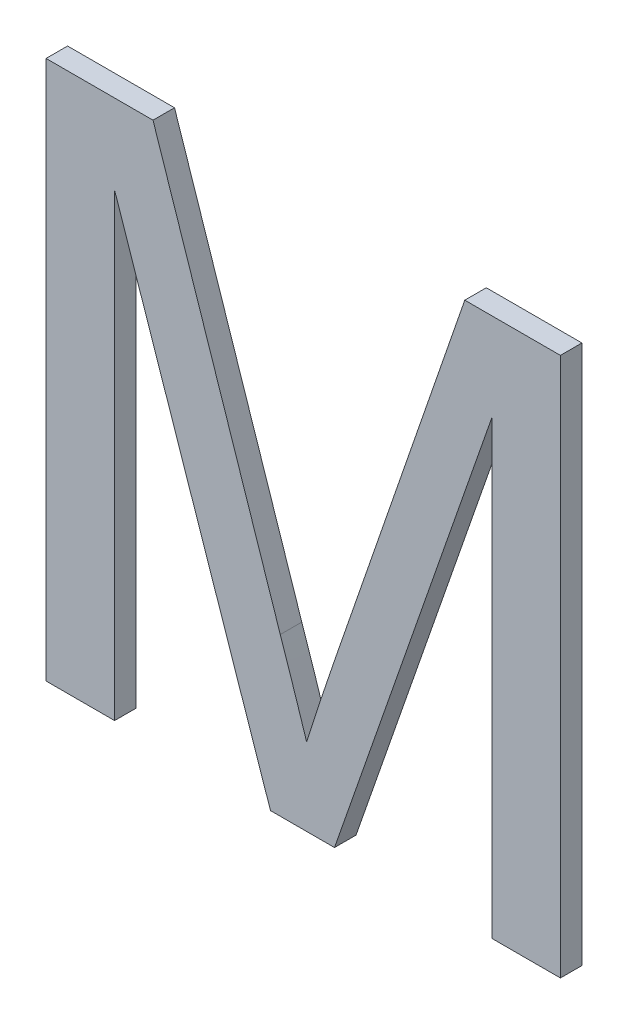
ISO-10303-21;
HEADER;
FILE_DESCRIPTION(('STEP AP214'),'2;1');
FILE_NAME('part.step','',(''),(''),'','','');
FILE_SCHEMA(('AUTOMOTIVE_DESIGN { 1 0 10303 214 1 1 1 1 }'));
ENDSEC;
DATA;
#1=APPLICATION_CONTEXT('core data for automotive mechanical design processes');
#2=APPLICATION_PROTOCOL_DEFINITION('international standard','automotive_design',2000,#1);
#3=PRODUCT_CONTEXT('',#1,'mechanical');
#4=PRODUCT('Part','Part','',(#3));
#5=PRODUCT_RELATED_PRODUCT_CATEGORY('part','',(#4));
#6=PRODUCT_DEFINITION_FORMATION('','',#4);
#7=PRODUCT_DEFINITION_CONTEXT('part definition',#1,'design');
#8=PRODUCT_DEFINITION('design','',#6,#7);
#9=PRODUCT_DEFINITION_SHAPE('','',#8);
#10=(LENGTH_UNIT() NAMED_UNIT(*) SI_UNIT(.MILLI.,.METRE.));
#11=(NAMED_UNIT(*) PLANE_ANGLE_UNIT() SI_UNIT($,.RADIAN.));
#12=(NAMED_UNIT(*) SI_UNIT($,.STERADIAN.) SOLID_ANGLE_UNIT());
#13=UNCERTAINTY_MEASURE_WITH_UNIT(LENGTH_MEASURE(1.E-05),#10,'distance_accuracy_value','');
#14=(GEOMETRIC_REPRESENTATION_CONTEXT(3) GLOBAL_UNCERTAINTY_ASSIGNED_CONTEXT((#13)) GLOBAL_UNIT_ASSIGNED_CONTEXT((#10,
#11,#12)) REPRESENTATION_CONTEXT('',''));
#15=CARTESIAN_POINT('',(0.,0.,0.));
#16=DIRECTION('',(0.,0.,1.));
#17=DIRECTION('',(1.,0.,0.));
#18=AXIS2_PLACEMENT_3D('',#15,#16,#17);
#19=CARTESIAN_POINT('',(-1.446119925892,-0.0356906440984299,1.59999999404));
#20=DIRECTION('',(0.,0.,1.));
#21=DIRECTION('',(0.,-1.,0.));
#22=AXIS2_PLACEMENT_3D('',#19,#20,#21);
#23=PLANE('',#22);
#24=CARTESIAN_POINT('',(-1.442922879755,-0.205535668321,1.59999999404));
#25=CARTESIAN_POINT('',(-1.44092107763567,-0.199176348546356,1.59999999404));
#26=CARTESIAN_POINT('',(-1.43890103639223,-0.192822640104888,1.59999999404));
#27=CARTESIAN_POINT('',(-1.43481467771414,-0.180130421972241,1.59999999404));
#28=CARTESIAN_POINT('',(-1.43274836217431,-0.173791911670458,1.59999999404));
#29=CARTESIAN_POINT('',(-1.4283091517931,-0.160377031806921,1.59999999404));
#30=CARTESIAN_POINT('',(-1.42592913344439,-0.153303025219422,1.59999999404));
#31=CARTESIAN_POINT('',(-1.42113873591681,-0.139165055267969,1.59999999404));
#32=CARTESIAN_POINT('',(-1.41872835592245,-0.132101092179473,1.59999999404));
#33=CARTESIAN_POINT('',(-1.416322921962,-0.125035672169,1.59999999404));
#34=B_SPLINE_CURVE_WITH_KNOTS('',3,(#24,#25,#26,#27,#28,#29,#30,#31,#32,#33),.UNSPECIFIED.,.F.,
.F.,(4,2,2,2,4),(0.,0.0200010165891082,0.040001215676193,0.0623919955204539,0.084783378055669),.UNSPECIFIED.);
#35=CARTESIAN_POINT('',(-1.442922879755,-0.205535668321,1.59999999404));
#36=VERTEX_POINT('',#35);
#37=CARTESIAN_POINT('',(-1.41632292196182,-0.125035672169062,1.59999999404));
#38=VERTEX_POINT('',#37);
#39=EDGE_CURVE('E24',#36,#38,#34,.T.);
#40=ORIENTED_EDGE('',*,*,#39,.F.);
#41=CARTESIAN_POINT('',(-1.467422883213,-0.131335665286,1.59999999404));
#42=CARTESIAN_POINT('',(-1.46529121304415,-0.137652295790562,1.59999999404));
#43=CARTESIAN_POINT('',(-1.46316083680655,-0.143969442109462,1.59999999404));
#44=CARTESIAN_POINT('',(-1.45891696680533,-0.156609410008246,1.59999999404));
#45=CARTESIAN_POINT('',(-1.4568034730754,-0.162932231599426,1.59999999404));
#46=CARTESIAN_POINT('',(-1.45070477066676,-0.181327951278226,1.59999999404));
#47=CARTESIAN_POINT('',(-1.44676067782992,-0.193414420819463,1.59999999404));
#48=CARTESIAN_POINT('',(-1.442922879755,-0.205535668321,1.59999999404));
#49=B_SPLINE_CURVE_WITH_KNOTS('',3,(#41,#42,#43,#44,#45,#46,#47,#48),.UNSPECIFIED.,.F.,.F.,(4,2,
2,4),(0.,0.0200000000015703,0.0400000398996513,0.078141112762146),.UNSPECIFIED.);
#50=CARTESIAN_POINT('',(-1.46742288321268,-0.131335665285894,1.59999999404));
#51=VERTEX_POINT('',#50);
#52=EDGE_CURVE('E129',#51,#36,#49,.T.);
#53=ORIENTED_EDGE('',*,*,#52,.F.);
#54=DIRECTION('',(-0.316227803956938,0.948683285403815,0.));
#55=VECTOR('',#54,1.);
#56=CARTESIAN_POINT('',(-1.526572890207,0.04611433204263,1.59999999404));
#57=LINE('',#56,#55);
#58=CARTESIAN_POINT('',(-1.58572289720189,0.223564329371038,1.59999999404));
#59=VERTEX_POINT('',#58);
#60=EDGE_CURVE('E273',#59,#51,#57,.F.);
#61=ORIENTED_EDGE('',*,*,#60,.F.);
#62=DIRECTION('',(1.,0.,0.));
#63=VECTOR('',#62,1.);
#64=CARTESIAN_POINT('',(-1.635422873124,0.223564329371,1.59999999404));
#65=LINE('',#64,#63);
#66=CARTESIAN_POINT('',(-1.685122849047,0.223564329371,1.59999999404));
#67=VERTEX_POINT('',#66);
#68=EDGE_CURVE('E266',#67,#59,#65,.T.);
#69=ORIENTED_EDGE('',*,*,#68,.F.);
#70=DIRECTION('',(0.,1.,0.));
#71=VECTOR('',#70,1.);
#72=CARTESIAN_POINT('',(-1.685122849047,-0.0270356701687001,1.59999999404));
#73=LINE('',#72,#71);
#74=CARTESIAN_POINT('',(-1.685122849047,-0.277635669708,1.59999999404));
#75=VERTEX_POINT('',#74);
#76=EDGE_CURVE('E261',#75,#67,#73,.T.);
#77=ORIENTED_EDGE('',*,*,#76,.F.);
#78=DIRECTION('',(1.,0.,0.));
#79=VECTOR('',#78,1.);
#80=CARTESIAN_POINT('',(-1.653272863477,-0.277635669708,1.59999999404));
#81=LINE('',#80,#79);
#82=CARTESIAN_POINT('',(-1.621422877908,-0.277635669708,1.59999999404));
#83=VERTEX_POINT('',#82);
#84=EDGE_CURVE('E257',#83,#75,#81,.F.);
#85=ORIENTED_EDGE('',*,*,#84,.F.);
#86=DIRECTION('',(0.,1.,0.));
#87=VECTOR('',#86,1.);
#88=CARTESIAN_POINT('',(-1.621422877908,-0.0641356716863801,1.59999999404));
#89=LINE('',#88,#87);
#90=CARTESIAN_POINT('',(-1.62142287790769,0.149364326335156,1.59999999404));
#91=VERTEX_POINT('',#90);
#92=EDGE_CURVE('E243',#91,#83,#89,.F.);
#93=ORIENTED_EDGE('',*,*,#92,.F.);
#94=DIRECTION('',(0.32134601016496,-0.946961848096883,0.));
#95=VECTOR('',#94,1.);
#96=CARTESIAN_POINT('',(-1.548972892016,-0.0641356716863801,1.59999999404));
#97=LINE('',#96,#95);
#98=CARTESIAN_POINT('',(-1.47652290612483,-0.277635669707942,1.59999999404));
#99=VERTEX_POINT('',#98);
#100=EDGE_CURVE('E233',#99,#91,#97,.F.);
#101=ORIENTED_EDGE('',*,*,#100,.F.);
#102=DIRECTION('',(1.,0.,0.));
#103=VECTOR('',#102,1.);
#104=CARTESIAN_POINT('',(-1.446772874892,-0.277635669708,1.59999999404));
#105=LINE('',#104,#103);
#106=CARTESIAN_POINT('',(-1.41702284365904,-0.277635669707991,1.59999999404));
#107=VERTEX_POINT('',#106);
#108=EDGE_CURVE('E223',#107,#99,#105,.F.);
#109=ORIENTED_EDGE('',*,*,#108,.F.);
#110=DIRECTION('',(0.329437331084959,0.944177443538883,0.));
#111=VECTOR('',#110,1.);
#112=CARTESIAN_POINT('',(-1.343872888759,-0.06798566682264,1.59999999404));
#113=LINE('',#112,#111);
#114=CARTESIAN_POINT('',(-1.27072293385896,0.141664336062985,1.59999999404));
#115=VERTEX_POINT('',#114);
#116=EDGE_CURVE('E213',#115,#107,#113,.F.);
#117=ORIENTED_EDGE('',*,*,#116,.F.);
#118=DIRECTION('',(0.,1.,0.));
#119=VECTOR('',#118,1.);
#120=CARTESIAN_POINT('',(-1.270722933859,-0.06798566682264,1.59999999404));
#121=LINE('',#120,#119);
#122=CARTESIAN_POINT('',(-1.270722933859,-0.277635669708,1.59999999404));
#123=VERTEX_POINT('',#122);
#124=EDGE_CURVE('E203',#123,#115,#121,.T.);
#125=ORIENTED_EDGE('',*,*,#124,.F.);
#126=DIRECTION('',(1.,0.,0.));
#127=VECTOR('',#126,1.);
#128=CARTESIAN_POINT('',(-1.238872900978,-0.277635669708,1.59999999404));
#129=LINE('',#128,#127);
#130=CARTESIAN_POINT('',(-1.207022868097,-0.277635669708,1.59999999404));
#131=VERTEX_POINT('',#130);
#132=EDGE_CURVE('E193',#131,#123,#129,.F.);
#133=ORIENTED_EDGE('',*,*,#132,.F.);
#134=DIRECTION('',(0.,1.,0.));
#135=VECTOR('',#134,1.);
#136=CARTESIAN_POINT('',(-1.207022868097,-0.0270356701687,1.59999999404));
#137=LINE('',#136,#135);
#138=CARTESIAN_POINT('',(-1.207022868097,0.223564329371,1.59999999404));
#139=VERTEX_POINT('',#138);
#140=EDGE_CURVE('E183',#139,#131,#137,.F.);
#141=ORIENTED_EDGE('',*,*,#140,.F.);
#142=DIRECTION('',(1.,0.,0.));
#143=VECTOR('',#142,1.);
#144=CARTESIAN_POINT('',(-1.251472863555,0.223564329371,1.59999999404));
#145=LINE('',#144,#143);
#146=CARTESIAN_POINT('',(-1.29592285901272,0.223564329370936,1.59999999404));
#147=VERTEX_POINT('',#146);
#148=EDGE_CURVE('E146',#147,#139,#145,.T.);
#149=ORIENTED_EDGE('',*,*,#148,.F.);
#150=DIRECTION('',(-0.326458743040992,-0.945211452052976,0.));
#151=VECTOR('',#150,1.);
#152=CARTESIAN_POINT('',(-1.356122890487,0.0492643286008398,1.59999999404));
#153=LINE('',#152,#151);
#154=EDGE_CURVE('E144',#38,#147,#153,.F.);
#155=ORIENTED_EDGE('',*,*,#154,.F.);
#156=EDGE_LOOP('',(#40,#53,#61,#69,#77,#85,#93,#101,#109,#117,#125,#133,#141,#149,#155));
#157=FACE_BOUND('',#156,.T.);
#158=ADVANCED_FACE('F17',(#157),#23,.T.);
#159=CARTESIAN_POINT('',(-1.653272863477,-0.277635669708,1.59999999404));
#160=DIRECTION('',(0.,-1.,0.));
#161=DIRECTION('',(0.,0.,-1.));
#162=AXIS2_PLACEMENT_3D('',#159,#160,#161);
#163=PLANE('',#162);
#164=DIRECTION('',(1.,0.,0.));
#165=VECTOR('',#164,1.);
#166=CARTESIAN_POINT('',(-1.446119925892,-0.277635669708,1.57999999404));
#167=LINE('',#166,#165);
#168=CARTESIAN_POINT('',(-1.685122849047,-0.277635669708,1.57999999404));
#169=VERTEX_POINT('',#168);
#170=CARTESIAN_POINT('',(-1.621422877908,-0.277635669708,1.57999999404));
#171=VERTEX_POINT('',#170);
#172=EDGE_CURVE('E238',#169,#171,#167,.T.);
#173=ORIENTED_EDGE('',*,*,#172,.T.);
#174=DIRECTION('',(0.,0.,-1.));
#175=VECTOR('',#174,1.);
#176=CARTESIAN_POINT('',(-1.621422877908,-0.277635669708,1.59999999404));
#177=LINE('',#176,#175);
#178=EDGE_CURVE('E241',#83,#171,#177,.T.);
#179=ORIENTED_EDGE('',*,*,#178,.F.);
#180=ORIENTED_EDGE('',*,*,#84,.T.);
#181=DIRECTION('',(0.,0.,1.));
#182=VECTOR('',#181,1.);
#183=CARTESIAN_POINT('',(-1.685122849047,-0.277635669708,1.59999999404));
#184=LINE('',#183,#182);
#185=EDGE_CURVE('E248',#169,#75,#184,.T.);
#186=ORIENTED_EDGE('',*,*,#185,.F.);
#187=EDGE_LOOP('',(#173,#179,#180,#186));
#188=FACE_BOUND('',#187,.T.);
#189=ADVANCED_FACE('F369',(#188),#163,.T.);
#190=CARTESIAN_POINT('',(-1.621422877908,-0.0641356716863801,1.59999999404));
#191=DIRECTION('',(1.,0.,0.));
#192=DIRECTION('',(0.,0.,-1.));
#193=AXIS2_PLACEMENT_3D('',#190,#191,#192);
#194=PLANE('',#193);
#195=DIRECTION('',(0.,-1.,0.));
#196=VECTOR('',#195,1.);
#197=CARTESIAN_POINT('',(-1.621422877908,-0.03569064409843,1.57999999404));
#198=LINE('',#197,#196);
#199=CARTESIAN_POINT('',(-1.62142287790785,0.149364326335052,1.57999999404));
#200=VERTEX_POINT('',#199);
#201=EDGE_CURVE('E228',#171,#200,#198,.F.);
#202=ORIENTED_EDGE('',*,*,#201,.T.);
#203=DIRECTION('',(0.,0.,1.));
#204=VECTOR('',#203,1.);
#205=CARTESIAN_POINT('',(-1.62142287790754,0.149364326335156,1.59999999404));
#206=LINE('',#205,#204);
#207=EDGE_CURVE('E231',#91,#200,#206,.F.);
#208=ORIENTED_EDGE('',*,*,#207,.F.);
#209=ORIENTED_EDGE('',*,*,#92,.T.);
#210=ORIENTED_EDGE('',*,*,#178,.T.);
#211=EDGE_LOOP('',(#202,#208,#209,#210));
#212=FACE_BOUND('',#211,.T.);
#213=ADVANCED_FACE('F365',(#212),#194,.T.);
#214=CARTESIAN_POINT('',(-1.548972892016,-0.0641356716863801,1.59999999404));
#215=DIRECTION('',(-0.946961848096883,-0.32134601016496,0.));
#216=DIRECTION('',(0.32134601016496,-0.946961848096883,0.));
#217=AXIS2_PLACEMENT_3D('',#214,#215,#216);
#218=PLANE('',#217);
#219=DIRECTION('',(0.321346010164842,-0.946961848096922,0.));
#220=VECTOR('',#219,1.);
#221=CARTESIAN_POINT('',(-1.621422877908,0.149364326335,1.57999999404));
#222=LINE('',#221,#220);
#223=CARTESIAN_POINT('',(-1.476522906125,-0.277635669708,1.57999999404));
#224=VERTEX_POINT('',#223);
#225=EDGE_CURVE('E218',#200,#224,#222,.T.);
#226=ORIENTED_EDGE('',*,*,#225,.T.);
#227=DIRECTION('',(0.,0.,-1.));
#228=VECTOR('',#227,1.);
#229=CARTESIAN_POINT('',(-1.476522906125,-0.277635669708,1.59999999404));
#230=LINE('',#229,#228);
#231=EDGE_CURVE('E221',#99,#224,#230,.T.);
#232=ORIENTED_EDGE('',*,*,#231,.F.);
#233=ORIENTED_EDGE('',*,*,#100,.T.);
#234=ORIENTED_EDGE('',*,*,#207,.T.);
#235=EDGE_LOOP('',(#226,#232,#233,#234));
#236=FACE_BOUND('',#235,.T.);
#237=ADVANCED_FACE('F361',(#236),#218,.T.);
#238=CARTESIAN_POINT('',(-1.446772874892,-0.277635669708,1.59999999404));
#239=DIRECTION('',(0.,-1.,0.));
#240=DIRECTION('',(0.,0.,-1.));
#241=AXIS2_PLACEMENT_3D('',#238,#239,#240);
#242=PLANE('',#241);
#243=DIRECTION('',(1.,0.,0.));
#244=VECTOR('',#243,1.);
#245=CARTESIAN_POINT('',(-1.446119925892,-0.277635669708,1.57999999404));
#246=LINE('',#245,#244);
#247=CARTESIAN_POINT('',(-1.41702284365901,-0.277635669707996,1.57999999404));
#248=VERTEX_POINT('',#247);
#249=EDGE_CURVE('E208',#224,#248,#246,.T.);
#250=ORIENTED_EDGE('',*,*,#249,.T.);
#251=DIRECTION('',(0.,0.,1.));
#252=VECTOR('',#251,1.);
#253=CARTESIAN_POINT('',(-1.41702284365904,-0.277635669707987,1.59999999404));
#254=LINE('',#253,#252);
#255=EDGE_CURVE('E211',#107,#248,#254,.F.);
#256=ORIENTED_EDGE('',*,*,#255,.F.);
#257=ORIENTED_EDGE('',*,*,#108,.T.);
#258=ORIENTED_EDGE('',*,*,#231,.T.);
#259=EDGE_LOOP('',(#250,#256,#257,#258));
#260=FACE_BOUND('',#259,.T.);
#261=ADVANCED_FACE('F357',(#260),#242,.T.);
#262=CARTESIAN_POINT('',(-1.343872888759,-0.06798566682264,1.59999999404));
#263=DIRECTION('',(0.944177443538883,-0.329437331084959,0.));
#264=DIRECTION('',(0.329437331084959,0.944177443538883,0.));
#265=AXIS2_PLACEMENT_3D('',#262,#263,#264);
#266=PLANE('',#265);
#267=DIRECTION('',(0.329437331084591,0.944177443539012,0.));
#268=VECTOR('',#267,1.);
#269=CARTESIAN_POINT('',(-1.417022843659,-0.277635669708,1.57999999404));
#270=LINE('',#269,#268);
#271=CARTESIAN_POINT('',(-1.270722933859,0.141664336063,1.57999999404));
#272=VERTEX_POINT('',#271);
#273=EDGE_CURVE('E198',#248,#272,#270,.T.);
#274=ORIENTED_EDGE('',*,*,#273,.T.);
#275=DIRECTION('',(0.,0.,1.));
#276=VECTOR('',#275,1.);
#277=CARTESIAN_POINT('',(-1.270722933859,0.141664336063,1.59999999404));
#278=LINE('',#277,#276);
#279=EDGE_CURVE('E201',#115,#272,#278,.F.);
#280=ORIENTED_EDGE('',*,*,#279,.F.);
#281=ORIENTED_EDGE('',*,*,#116,.T.);
#282=ORIENTED_EDGE('',*,*,#255,.T.);
#283=EDGE_LOOP('',(#274,#280,#281,#282));
#284=FACE_BOUND('',#283,.T.);
#285=ADVANCED_FACE('F353',(#284),#266,.T.);
#286=CARTESIAN_POINT('',(-1.270722933859,-0.06798566682264,1.59999999404));
#287=DIRECTION('',(-1.,0.,0.));
#288=DIRECTION('',(0.,0.,1.));
#289=AXIS2_PLACEMENT_3D('',#286,#287,#288);
#290=PLANE('',#289);
#291=DIRECTION('',(0.,-1.,0.));
#292=VECTOR('',#291,1.);
#293=CARTESIAN_POINT('',(-1.270722933859,-0.03569064409843,1.57999999404));
#294=LINE('',#293,#292);
#295=CARTESIAN_POINT('',(-1.270722933859,-0.277635669708,1.57999999404));
#296=VERTEX_POINT('',#295);
#297=EDGE_CURVE('E188',#272,#296,#294,.T.);
#298=ORIENTED_EDGE('',*,*,#297,.T.);
#299=DIRECTION('',(0.,0.,-1.));
#300=VECTOR('',#299,1.);
#301=CARTESIAN_POINT('',(-1.270722933859,-0.277635669708,1.59999999404));
#302=LINE('',#301,#300);
#303=EDGE_CURVE('E191',#123,#296,#302,.T.);
#304=ORIENTED_EDGE('',*,*,#303,.F.);
#305=ORIENTED_EDGE('',*,*,#124,.T.);
#306=ORIENTED_EDGE('',*,*,#279,.T.);
#307=EDGE_LOOP('',(#298,#304,#305,#306));
#308=FACE_BOUND('',#307,.T.);
#309=ADVANCED_FACE('F349',(#308),#290,.T.);
#310=CARTESIAN_POINT('',(-1.238872900978,-0.277635669708,1.59999999404));
#311=DIRECTION('',(0.,-1.,0.));
#312=DIRECTION('',(0.,0.,-1.));
#313=AXIS2_PLACEMENT_3D('',#310,#311,#312);
#314=PLANE('',#313);
#315=DIRECTION('',(1.,0.,0.));
#316=VECTOR('',#315,1.);
#317=CARTESIAN_POINT('',(-1.446119925892,-0.277635669708,1.57999999404));
#318=LINE('',#317,#316);
#319=CARTESIAN_POINT('',(-1.207022868097,-0.277635669708,1.57999999404));
#320=VERTEX_POINT('',#319);
#321=EDGE_CURVE('E178',#296,#320,#318,.T.);
#322=ORIENTED_EDGE('',*,*,#321,.T.);
#323=DIRECTION('',(0.,0.,-1.));
#324=VECTOR('',#323,1.);
#325=CARTESIAN_POINT('',(-1.207022868097,-0.277635669708,1.59999999404));
#326=LINE('',#325,#324);
#327=EDGE_CURVE('E181',#131,#320,#326,.T.);
#328=ORIENTED_EDGE('',*,*,#327,.F.);
#329=ORIENTED_EDGE('',*,*,#132,.T.);
#330=ORIENTED_EDGE('',*,*,#303,.T.);
#331=EDGE_LOOP('',(#322,#328,#329,#330));
#332=FACE_BOUND('',#331,.T.);
#333=ADVANCED_FACE('F345',(#332),#314,.T.);
#334=CARTESIAN_POINT('',(-1.207022868097,-0.0270356701687,1.59999999404));
#335=DIRECTION('',(1.,0.,0.));
#336=DIRECTION('',(0.,0.,-1.));
#337=AXIS2_PLACEMENT_3D('',#334,#335,#336);
#338=PLANE('',#337);
#339=DIRECTION('',(0.,-1.,0.));
#340=VECTOR('',#339,1.);
#341=CARTESIAN_POINT('',(-1.207022868097,-0.03569064409843,1.57999999404));
#342=LINE('',#341,#340);
#343=CARTESIAN_POINT('',(-1.207022868097,0.223564329371,1.57999999404));
#344=VERTEX_POINT('',#343);
#345=EDGE_CURVE('E170',#320,#344,#342,.F.);
#346=ORIENTED_EDGE('',*,*,#345,.T.);
#347=DIRECTION('',(0.,0.,1.));
#348=VECTOR('',#347,1.);
#349=CARTESIAN_POINT('',(-1.207022868097,0.223564329371,1.59999999404));
#350=LINE('',#349,#348);
#351=EDGE_CURVE('E149',#139,#344,#350,.F.);
#352=ORIENTED_EDGE('',*,*,#351,.F.);
#353=ORIENTED_EDGE('',*,*,#140,.T.);
#354=ORIENTED_EDGE('',*,*,#327,.T.);
#355=EDGE_LOOP('',(#346,#352,#353,#354));
#356=FACE_BOUND('',#355,.T.);
#357=ADVANCED_FACE('F341',(#356),#338,.T.);
#358=CARTESIAN_POINT('',(-1.251472863555,0.223564329371,1.59999999404));
#359=DIRECTION('',(0.,1.,0.));
#360=DIRECTION('',(0.,0.,1.));
#361=AXIS2_PLACEMENT_3D('',#358,#359,#360);
#362=PLANE('',#361);
#363=DIRECTION('',(1.,0.,0.));
#364=VECTOR('',#363,1.);
#365=CARTESIAN_POINT('',(-1.446119925892,0.223564329371,1.57999999404));
#366=LINE('',#365,#364);
#367=CARTESIAN_POINT('',(-1.29592285901291,0.223564329370968,1.57999999404));
#368=VERTEX_POINT('',#367);
#369=EDGE_CURVE('E162',#344,#368,#366,.F.);
#370=ORIENTED_EDGE('',*,*,#369,.T.);
#371=DIRECTION('',(0.,0.,1.));
#372=VECTOR('',#371,1.);
#373=CARTESIAN_POINT('',(-1.29592285901272,0.223564329370903,1.59999999404));
#374=LINE('',#373,#372);
#375=EDGE_CURVE('E142',#147,#368,#374,.F.);
#376=ORIENTED_EDGE('',*,*,#375,.F.);
#377=ORIENTED_EDGE('',*,*,#148,.T.);
#378=ORIENTED_EDGE('',*,*,#351,.T.);
#379=EDGE_LOOP('',(#370,#376,#377,#378));
#380=FACE_BOUND('',#379,.T.);
#381=ADVANCED_FACE('F338',(#380),#362,.T.);
#382=CARTESIAN_POINT('',(-1.356122890487,0.0492643286008398,1.59999999404));
#383=DIRECTION('',(-0.945211452052976,0.326458743040992,0.));
#384=DIRECTION('',(-0.326458743040992,-0.945211452052976,0.));
#385=AXIS2_PLACEMENT_3D('',#382,#383,#384);
#386=PLANE('',#385);
#387=DIRECTION('',(-0.326458743042165,-0.945211452052571,0.));
#388=VECTOR('',#387,1.);
#389=CARTESIAN_POINT('',(-1.295922859013,0.223564329371,1.57999999404));
#390=LINE('',#389,#388);
#391=CARTESIAN_POINT('',(-1.416322921962,-0.125035672169,1.57999999404));
#392=VERTEX_POINT('',#391);
#393=EDGE_CURVE('E154',#368,#392,#390,.T.);
#394=ORIENTED_EDGE('',*,*,#393,.T.);
#395=DIRECTION('',(0.,0.,-1.));
#396=VECTOR('',#395,1.);
#397=CARTESIAN_POINT('',(-1.416322921962,-0.125035672169,1.58999999404));
#398=LINE('',#397,#396);
#399=EDGE_CURVE('E138',#38,#392,#398,.T.);
#400=ORIENTED_EDGE('',*,*,#399,.F.);
#401=ORIENTED_EDGE('',*,*,#154,.T.);
#402=ORIENTED_EDGE('',*,*,#375,.T.);
#403=EDGE_LOOP('',(#394,#400,#401,#402));
#404=FACE_BOUND('',#403,.T.);
#405=ADVANCED_FACE('F152',(#404),#386,.T.);
#406=CARTESIAN_POINT('',(-1.442922879755,-0.205535668321,1.59999999404));
#407=CARTESIAN_POINT('',(-1.442922879755,-0.205535668321,1.57999999404));
#408=CARTESIAN_POINT('',(-1.43868153458,-0.192056635447,1.59999999404));
#409=CARTESIAN_POINT('',(-1.43868153458,-0.192056635447,1.57999999404));
#410=CARTESIAN_POINT('',(-1.43002587267,-0.165152738692,1.59999999404));
#411=CARTESIAN_POINT('',(-1.43002587267,-0.165152738692,1.57999999404));
#412=CARTESIAN_POINT('',(-1.420875004775,-0.138412961811,1.59999999404));
#413=CARTESIAN_POINT('',(-1.420875004775,-0.138412961811,1.57999999404));
#414=CARTESIAN_POINT('',(-1.416322921962,-0.125035672169,1.59999999404));
#415=CARTESIAN_POINT('',(-1.416322921962,-0.125035672169,1.57999999404));
#416=B_SPLINE_SURFACE_WITH_KNOTS('',3,1,((#406,#407),(#408,#409),(#410,#411),(#412,#413),(#414,
#415)),.UNSPECIFIED.,.F.,.F.,.F.,(4,1,4),(2,2),(0.,0.001668966329662,0.003337932659324),(0.,1.),.UNSPECIFIED.);
#417=CARTESIAN_POINT('',(-1.416322921962,-0.125035672169,1.57999999404));
#418=CARTESIAN_POINT('',(-1.41846983025715,-0.131347095809452,1.57999999404));
#419=CARTESIAN_POINT('',(-1.42062297660035,-0.137656532567552,1.57999999404));
#420=CARTESIAN_POINT('',(-1.42490879465961,-0.150282388520031,1.57999999404));
#421=CARTESIAN_POINT('',(-1.42704146622373,-0.156598807765837,1.57999999404));
#422=CARTESIAN_POINT('',(-1.43150508097067,-0.170005579205841,1.57999999404));
#423=CARTESIAN_POINT('',(-1.43382925222515,-0.177098192000234,1.57999999404));
#424=CARTESIAN_POINT('',(-1.43841850043133,-0.191303099534739,1.57999999404));
#425=CARTESIAN_POINT('',(-1.44068357301677,-0.198415395686373,1.57999999404));
#426=CARTESIAN_POINT('',(-1.442922879755,-0.205535668321,1.57999999404));
#427=B_SPLINE_CURVE_WITH_KNOTS('',3,(#417,#418,#419,#420,#421,#422,#423,#424,#425,#426),
.UNSPECIFIED.,.F.,.F.,(4,2,2,2,4),(0.,0.0199999783604006,0.0400001050149523,0.0623909083443781,
0.0847833612611371),.UNSPECIFIED.);
#428=CARTESIAN_POINT('',(-1.442922879755,-0.205535668321,1.57999999404));
#429=VERTEX_POINT('',#428);
#430=EDGE_CURVE('E161',#392,#429,#427,.T.);
#431=DIRECTION('',(0.,0.,-1.));
#432=VECTOR('',#431,1.);
#433=CARTESIAN_POINT('',(-1.442922879755,-0.205535668321,1.58999999404));
#434=LINE('',#433,#432);
#435=EDGE_CURVE('E140',#36,#429,#434,.T.);
#436=ORIENTED_EDGE('',*,*,#430,.T.);
#437=ORIENTED_EDGE('',*,*,#435,.F.);
#438=ORIENTED_EDGE('',*,*,#39,.T.);
#439=ORIENTED_EDGE('',*,*,#399,.T.);
#440=EDGE_LOOP('',(#436,#437,#438,#439));
#441=FACE_BOUND('',#440,.T.);
#442=ADVANCED_FACE('F136',(#441),#416,.T.);
#443=CARTESIAN_POINT('',(-1.467422883213,-0.131335665286,1.59999999404));
#444=CARTESIAN_POINT('',(-1.467422883213,-0.131335665286,1.57999999404));
#445=CARTESIAN_POINT('',(-1.463265625355,-0.143677870273,1.59999999404));
#446=CARTESIAN_POINT('',(-1.463265625355,-0.143677870273,1.57999999404));
#447=CARTESIAN_POINT('',(-1.454919663188,-0.168352164823,1.59999999404));
#448=CARTESIAN_POINT('',(-1.454919663188,-0.168352164823,1.57999999404));
#449=CARTESIAN_POINT('',(-1.446885649449,-0.1931296507,1.59999999404));
#450=CARTESIAN_POINT('',(-1.446885649449,-0.1931296507,1.57999999404));
#451=CARTESIAN_POINT('',(-1.442922879755,-0.205535668321,1.59999999404));
#452=CARTESIAN_POINT('',(-1.442922879755,-0.205535668321,1.57999999404));
#453=B_SPLINE_SURFACE_WITH_KNOTS('',3,1,((#443,#444),(#445,#446),(#447,#448),(#449,#450),(#451,
#452)),.UNSPECIFIED.,.F.,.F.,.F.,(4,1,4),(2,2),(0.,0.001538214395788,0.003076428791576),(0.,1.),.UNSPECIFIED.);
#454=CARTESIAN_POINT('',(-1.442922879755,-0.205535668321,1.57999999404));
#455=CARTESIAN_POINT('',(-1.44494777995678,-0.199183899298942,1.57999999404));
#456=CARTESIAN_POINT('',(-1.44699232522601,-0.192838442289053,1.57999999404));
#457=CARTESIAN_POINT('',(-1.45111622189295,-0.180158834605574,1.57999999404));
#458=CARTESIAN_POINT('',(-1.45319557333764,-0.173824683947256,1.57999999404));
#459=CARTESIAN_POINT('',(-1.45928440814738,-0.155425564520415,1.57999999404));
#460=CARTESIAN_POINT('',(-1.46333386129111,-0.1433737874921,1.57999999404));
#461=CARTESIAN_POINT('',(-1.467422883213,-0.131335665286,1.57999999404));
#462=B_SPLINE_CURVE_WITH_KNOTS('',3,(#454,#455,#456,#457,#458,#459,#460,#461),.UNSPECIFIED.,.F.,
.F.,(4,2,2,4),(0.,0.0200000579106447,0.040000142816533,0.0781412112586654),.UNSPECIFIED.);
#463=CARTESIAN_POINT('',(-1.46742288321257,-0.131335665285736,1.57999999404));
#464=VERTEX_POINT('',#463);
#465=EDGE_CURVE('E306',#429,#464,#462,.T.);
#466=DIRECTION('',(0.,0.,1.));
#467=VECTOR('',#466,1.);
#468=CARTESIAN_POINT('',(-1.46742288321236,-0.131335665285788,1.59999999404));
#469=LINE('',#468,#467);
#470=EDGE_CURVE('E158',#51,#464,#469,.F.);
#471=ORIENTED_EDGE('',*,*,#465,.T.);
#472=ORIENTED_EDGE('',*,*,#470,.F.);
#473=ORIENTED_EDGE('',*,*,#52,.T.);
#474=ORIENTED_EDGE('',*,*,#435,.T.);
#475=EDGE_LOOP('',(#471,#472,#473,#474));
#476=FACE_BOUND('',#475,.T.);
#477=ADVANCED_FACE('F19',(#476),#453,.T.);
#478=CARTESIAN_POINT('',(-1.526572890207,0.04611433204263,1.59999999404));
#479=DIRECTION('',(0.948683285403815,0.316227803956938,0.));
#480=DIRECTION('',(-0.316227803956938,0.948683285403815,0.));
#481=AXIS2_PLACEMENT_3D('',#478,#479,#480);
#482=PLANE('',#481);
#483=DIRECTION('',(-0.316227803956953,0.948683285403809,0.));
#484=VECTOR('',#483,1.);
#485=CARTESIAN_POINT('',(-1.467422883213,-0.131335665285,1.57999999404));
#486=LINE('',#485,#484);
#487=CARTESIAN_POINT('',(-1.58572289720183,0.223564329371057,1.57999999404));
#488=VERTEX_POINT('',#487);
#489=EDGE_CURVE('E314',#464,#488,#486,.T.);
#490=ORIENTED_EDGE('',*,*,#489,.T.);
#491=DIRECTION('',(0.,0.,1.));
#492=VECTOR('',#491,1.);
#493=CARTESIAN_POINT('',(-1.585722897202,0.223564329371,1.59999999404));
#494=LINE('',#493,#492);
#495=EDGE_CURVE('E263',#59,#488,#494,.F.);
#496=ORIENTED_EDGE('',*,*,#495,.F.);
#497=ORIENTED_EDGE('',*,*,#60,.T.);
#498=ORIENTED_EDGE('',*,*,#470,.T.);
#499=EDGE_LOOP('',(#490,#496,#497,#498));
#500=FACE_BOUND('',#499,.T.);
#501=ADVANCED_FACE('F331',(#500),#482,.T.);
#502=CARTESIAN_POINT('',(-1.635422873124,0.223564329371,1.59999999404));
#503=DIRECTION('',(0.,1.,0.));
#504=DIRECTION('',(0.,0.,1.));
#505=AXIS2_PLACEMENT_3D('',#502,#503,#504);
#506=PLANE('',#505);
#507=DIRECTION('',(1.,0.,0.));
#508=VECTOR('',#507,1.);
#509=CARTESIAN_POINT('',(-1.446119925892,0.223564329371,1.57999999404));
#510=LINE('',#509,#508);
#511=CARTESIAN_POINT('',(-1.685122849047,0.223564329371,1.57999999404));
#512=VERTEX_POINT('',#511);
#513=EDGE_CURVE('E35',#488,#512,#510,.F.);
#514=ORIENTED_EDGE('',*,*,#513,.T.);
#515=DIRECTION('',(0.,0.,1.));
#516=VECTOR('',#515,1.);
#517=CARTESIAN_POINT('',(-1.685122849047,0.223564329371,1.59999999404));
#518=LINE('',#517,#516);
#519=EDGE_CURVE('E43',#67,#512,#518,.F.);
#520=ORIENTED_EDGE('',*,*,#519,.F.);
#521=ORIENTED_EDGE('',*,*,#68,.T.);
#522=ORIENTED_EDGE('',*,*,#495,.T.);
#523=EDGE_LOOP('',(#514,#520,#521,#522));
#524=FACE_BOUND('',#523,.T.);
#525=ADVANCED_FACE('F328',(#524),#506,.T.);
#526=CARTESIAN_POINT('',(-1.685122849047,-0.0270356701687001,1.59999999404));
#527=DIRECTION('',(-1.,0.,0.));
#528=DIRECTION('',(0.,0.,1.));
#529=AXIS2_PLACEMENT_3D('',#526,#527,#528);
#530=PLANE('',#529);
#531=DIRECTION('',(0.,-1.,0.));
#532=VECTOR('',#531,1.);
#533=CARTESIAN_POINT('',(-1.685122849047,-0.0356906440984299,1.57999999404));
#534=LINE('',#533,#532);
#535=EDGE_CURVE('E11',#512,#169,#534,.T.);
#536=ORIENTED_EDGE('',*,*,#535,.T.);
#537=ORIENTED_EDGE('',*,*,#185,.T.);
#538=ORIENTED_EDGE('',*,*,#76,.T.);
#539=ORIENTED_EDGE('',*,*,#519,.T.);
#540=EDGE_LOOP('',(#536,#537,#538,#539));
#541=FACE_BOUND('',#540,.T.);
#542=ADVANCED_FACE('F323',(#541),#530,.T.);
#543=CARTESIAN_POINT('',(-1.446119925892,-0.0356906440984299,1.57999999404));
#544=DIRECTION('',(0.,0.,1.));
#545=DIRECTION('',(0.,-1.,0.));
#546=AXIS2_PLACEMENT_3D('',#543,#544,#545);
#547=PLANE('',#546);
#548=ORIENTED_EDGE('',*,*,#513,.F.);
#549=ORIENTED_EDGE('',*,*,#489,.F.);
#550=ORIENTED_EDGE('',*,*,#465,.F.);
#551=ORIENTED_EDGE('',*,*,#430,.F.);
#552=ORIENTED_EDGE('',*,*,#393,.F.);
#553=ORIENTED_EDGE('',*,*,#369,.F.);
#554=ORIENTED_EDGE('',*,*,#345,.F.);
#555=ORIENTED_EDGE('',*,*,#321,.F.);
#556=ORIENTED_EDGE('',*,*,#297,.F.);
#557=ORIENTED_EDGE('',*,*,#273,.F.);
#558=ORIENTED_EDGE('',*,*,#249,.F.);
#559=ORIENTED_EDGE('',*,*,#225,.F.);
#560=ORIENTED_EDGE('',*,*,#201,.F.);
#561=ORIENTED_EDGE('',*,*,#172,.F.);
#562=ORIENTED_EDGE('',*,*,#535,.F.);
#563=EDGE_LOOP('',(#548,#549,#550,#551,#552,#553,#554,#555,#556,#557,#558,#559,#560,#561,#562));
#564=FACE_BOUND('',#563,.T.);
#565=ADVANCED_FACE('F319',(#564),#547,.F.);
#566=CLOSED_SHELL('',(#158,#189,#213,#237,#261,#285,#309,#333,#357,#381,#405,#442,#477,#501,
#525,#542,#565));
#567=MANIFOLD_SOLID_BREP('B1',#566);
#568=ADVANCED_BREP_SHAPE_REPRESENTATION('',(#18,#567),#14);
#569=SHAPE_DEFINITION_REPRESENTATION(#9,#568);
ENDSEC;
END-ISO-10303-21;
